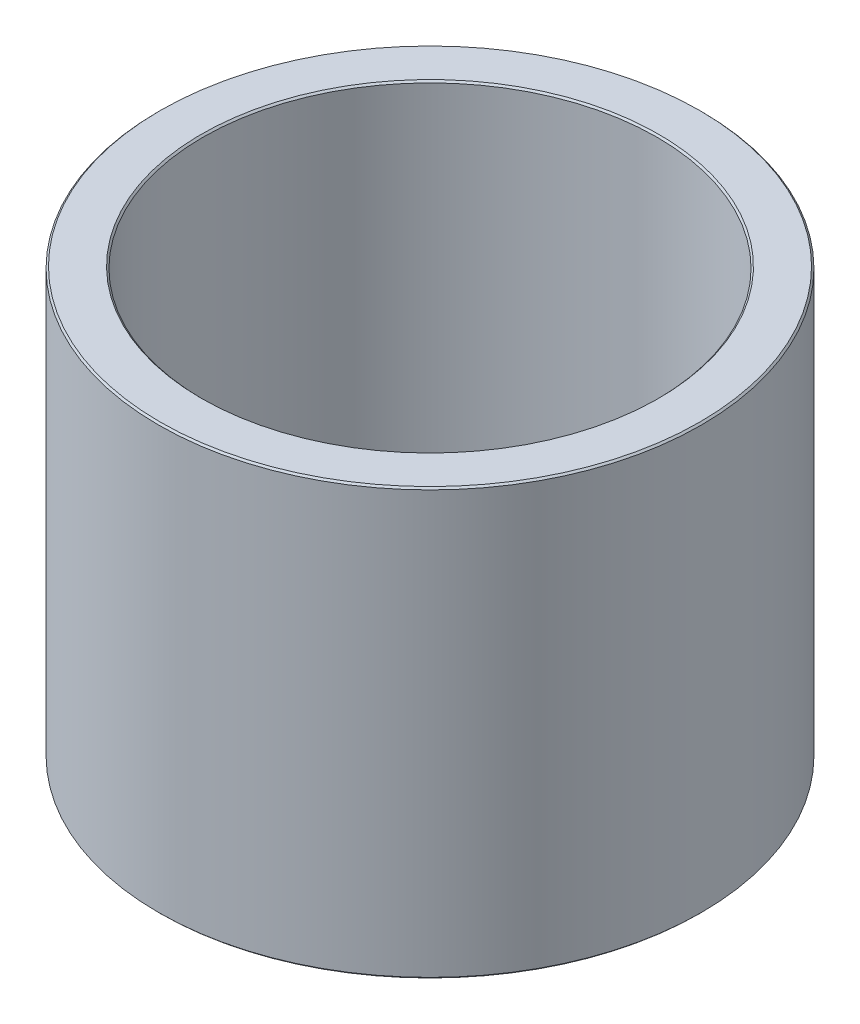
ISO-10303-21;
HEADER;
FILE_DESCRIPTION(('STEP AP214'),'2;1');
FILE_NAME('part.step','',(''),(''),'','','');
FILE_SCHEMA(('AUTOMOTIVE_DESIGN { 1 0 10303 214 1 1 1 1 }'));
ENDSEC;
DATA;
#1=APPLICATION_CONTEXT('core data for automotive mechanical design processes');
#2=APPLICATION_PROTOCOL_DEFINITION('international standard','automotive_design',2000,#1);
#3=PRODUCT_CONTEXT('',#1,'mechanical');
#4=PRODUCT('Part','Part','',(#3));
#5=PRODUCT_RELATED_PRODUCT_CATEGORY('part','',(#4));
#6=PRODUCT_DEFINITION_FORMATION('','',#4);
#7=PRODUCT_DEFINITION_CONTEXT('part definition',#1,'design');
#8=PRODUCT_DEFINITION('design','',#6,#7);
#9=PRODUCT_DEFINITION_SHAPE('','',#8);
#10=(LENGTH_UNIT() NAMED_UNIT(*) SI_UNIT(.MILLI.,.METRE.));
#11=(NAMED_UNIT(*) PLANE_ANGLE_UNIT() SI_UNIT($,.RADIAN.));
#12=(NAMED_UNIT(*) SI_UNIT($,.STERADIAN.) SOLID_ANGLE_UNIT());
#13=UNCERTAINTY_MEASURE_WITH_UNIT(LENGTH_MEASURE(1.E-05),#10,'distance_accuracy_value','');
#14=(GEOMETRIC_REPRESENTATION_CONTEXT(3) GLOBAL_UNCERTAINTY_ASSIGNED_CONTEXT((#13)) GLOBAL_UNIT_ASSIGNED_CONTEXT((#10,
#11,#12)) REPRESENTATION_CONTEXT('',''));
#15=CARTESIAN_POINT('',(0.,0.,0.));
#16=DIRECTION('',(0.,0.,1.));
#17=DIRECTION('',(1.,0.,0.));
#18=AXIS2_PLACEMENT_3D('',#15,#16,#17);
#19=CARTESIAN_POINT('',(0.,78.3762215863073,0.));
#20=DIRECTION('',(0.,-1.,0.));
#21=DIRECTION('',(0.,0.,-1.));
#22=AXIS2_PLACEMENT_3D('',#19,#20,#21);
#23=CYLINDRICAL_SURFACE('',#22,50.);
#24=CARTESIAN_POINT('',(0.,0.312434308337106,0.));
#25=DIRECTION('',(0.,1.,0.));
#26=DIRECTION('',(0.,0.,1.));
#27=AXIS2_PLACEMENT_3D('',#24,#25,#26);
#28=CIRCLE('',#27,50.);
#29=CARTESIAN_POINT('',(0.,0.312434308337106,50.));
#30=VERTEX_POINT('',#29);
#31=EDGE_CURVE('E10',#30,#30,#28,.T.);
#32=ORIENTED_EDGE('',*,*,#31,.T.);
#33=EDGE_LOOP('',(#32));
#34=FACE_BOUND('',#33,.T.);
#35=CARTESIAN_POINT('',(0.,78.0637872779701,0.));
#36=DIRECTION('',(0.,1.,0.));
#37=DIRECTION('',(0.,0.,1.));
#38=AXIS2_PLACEMENT_3D('',#35,#36,#37);
#39=CIRCLE('',#38,50.);
#40=CARTESIAN_POINT('',(0.,78.0637872779701,50.));
#41=VERTEX_POINT('',#40);
#42=EDGE_CURVE('E50',#41,#41,#39,.F.);
#43=ORIENTED_EDGE('',*,*,#42,.T.);
#44=EDGE_LOOP('',(#43));
#45=FACE_BOUND('',#44,.T.);
#46=ADVANCED_FACE('F39',(#34,#45),#23,.T.);
#47=CARTESIAN_POINT('',(0.,78.3762215863073,0.));
#48=DIRECTION('',(0.,1.,0.));
#49=DIRECTION('',(0.,0.,1.));
#50=AXIS2_PLACEMENT_3D('',#47,#48,#49);
#51=PLANE('',#50);
#52=CARTESIAN_POINT('',(0.,78.3762215863073,0.));
#53=DIRECTION('',(0.,1.,0.));
#54=DIRECTION('',(0.,0.,1.));
#55=AXIS2_PLACEMENT_3D('',#52,#53,#54);
#56=CIRCLE('',#55,42.1234506689392);
#57=CARTESIAN_POINT('',(0.,78.3762215863073,42.1234506689392));
#58=VERTEX_POINT('',#57);
#59=EDGE_CURVE('E58',#58,#58,#56,.F.);
#60=ORIENTED_EDGE('',*,*,#59,.T.);
#61=EDGE_LOOP('',(#60));
#62=FACE_BOUND('',#61,.T.);
#63=CARTESIAN_POINT('',(0.,78.3762215863073,0.));
#64=DIRECTION('',(0.,1.,0.));
#65=DIRECTION('',(0.,0.,1.));
#66=AXIS2_PLACEMENT_3D('',#63,#64,#65);
#67=CIRCLE('',#66,49.6875656916629);
#68=CARTESIAN_POINT('',(0.,78.3762215863073,49.6875656916629));
#69=VERTEX_POINT('',#68);
#70=EDGE_CURVE('E61',#69,#69,#67,.T.);
#71=ORIENTED_EDGE('',*,*,#70,.T.);
#72=EDGE_LOOP('',(#71));
#73=FACE_BOUND('',#72,.T.);
#74=ADVANCED_FACE('F88',(#62,#73),#51,.T.);
#75=CARTESIAN_POINT('',(0.,0.,0.));
#76=DIRECTION('',(0.,1.,0.));
#77=DIRECTION('',(0.,0.,1.));
#78=AXIS2_PLACEMENT_3D('',#75,#76,#77);
#79=PLANE('',#78);
#80=CARTESIAN_POINT('',(0.,0.,0.));
#81=DIRECTION('',(0.,1.,0.));
#82=DIRECTION('',(0.,0.,1.));
#83=AXIS2_PLACEMENT_3D('',#80,#81,#82);
#84=CIRCLE('',#83,42.1234506689393);
#85=CARTESIAN_POINT('',(0.,0.,42.1234506689393));
#86=VERTEX_POINT('',#85);
#87=EDGE_CURVE('E51',#86,#86,#84,.T.);
#88=ORIENTED_EDGE('',*,*,#87,.T.);
#89=EDGE_LOOP('',(#88));
#90=FACE_BOUND('',#89,.T.);
#91=CARTESIAN_POINT('',(0.,0.,0.));
#92=DIRECTION('',(0.,1.,0.));
#93=DIRECTION('',(0.,0.,1.));
#94=AXIS2_PLACEMENT_3D('',#91,#92,#93);
#95=CIRCLE('',#94,49.6875656916629);
#96=CARTESIAN_POINT('',(0.,0.,49.6875656916629));
#97=VERTEX_POINT('',#96);
#98=EDGE_CURVE('E54',#97,#97,#95,.F.);
#99=ORIENTED_EDGE('',*,*,#98,.T.);
#100=EDGE_LOOP('',(#99));
#101=FACE_BOUND('',#100,.T.);
#102=ADVANCED_FACE('F83',(#90,#101),#79,.F.);
#103=CARTESIAN_POINT('',(0.,78.3762215863073,0.));
#104=DIRECTION('',(0.,-1.,0.));
#105=DIRECTION('',(0.,0.,-1.));
#106=AXIS2_PLACEMENT_3D('',#103,#104,#105);
#107=CYLINDRICAL_SURFACE('',#106,41.8110163606022);
#108=CARTESIAN_POINT('',(0.,78.0637872779702,0.));
#109=DIRECTION('',(0.,1.,0.));
#110=DIRECTION('',(0.,0.,1.));
#111=AXIS2_PLACEMENT_3D('',#108,#109,#110);
#112=CIRCLE('',#111,41.8110163606022);
#113=CARTESIAN_POINT('',(0.,78.0637872779702,41.8110163606022));
#114=VERTEX_POINT('',#113);
#115=EDGE_CURVE('E67',#114,#114,#112,.T.);
#116=ORIENTED_EDGE('',*,*,#115,.T.);
#117=EDGE_LOOP('',(#116));
#118=FACE_BOUND('',#117,.T.);
#119=CARTESIAN_POINT('',(0.,0.31243430833712,0.));
#120=DIRECTION('',(0.,1.,0.));
#121=DIRECTION('',(0.,0.,1.));
#122=AXIS2_PLACEMENT_3D('',#119,#120,#121);
#123=CIRCLE('',#122,41.8110163606022);
#124=CARTESIAN_POINT('',(0.,0.31243430833712,41.8110163606022));
#125=VERTEX_POINT('',#124);
#126=EDGE_CURVE('E69',#125,#125,#123,.F.);
#127=ORIENTED_EDGE('',*,*,#126,.T.);
#128=EDGE_LOOP('',(#127));
#129=FACE_BOUND('',#128,.T.);
#130=ADVANCED_FACE('F71',(#118,#129),#107,.F.);
#131=CARTESIAN_POINT('',(0.,78.0637872779702,0.));
#132=DIRECTION('',(0.,1.,0.));
#133=DIRECTION('',(0.,0.,1.));
#134=AXIS2_PLACEMENT_3D('',#131,#132,#133);
#135=CONICAL_SURFACE('',#134,41.8110163606022,0.785398163397448);
#136=ORIENTED_EDGE('',*,*,#59,.F.);
#137=EDGE_LOOP('',(#136));
#138=FACE_BOUND('',#137,.T.);
#139=ORIENTED_EDGE('',*,*,#115,.F.);
#140=EDGE_LOOP('',(#139));
#141=FACE_BOUND('',#140,.T.);
#142=ADVANCED_FACE('F77',(#138,#141),#135,.F.);
#143=CARTESIAN_POINT('',(0.,0.,0.));
#144=DIRECTION('',(0.,-1.,0.));
#145=DIRECTION('',(0.,0.,-1.));
#146=AXIS2_PLACEMENT_3D('',#143,#144,#145);
#147=CONICAL_SURFACE('',#146,42.1234506689393,0.785398163397448);
#148=ORIENTED_EDGE('',*,*,#126,.F.);
#149=EDGE_LOOP('',(#148));
#150=FACE_BOUND('',#149,.T.);
#151=ORIENTED_EDGE('',*,*,#87,.F.);
#152=EDGE_LOOP('',(#151));
#153=FACE_BOUND('',#152,.T.);
#154=ADVANCED_FACE('F73',(#150,#153),#147,.F.);
#155=CARTESIAN_POINT('',(0.,0.312434308337106,0.));
#156=DIRECTION('',(0.,1.,0.));
#157=DIRECTION('',(0.,0.,1.));
#158=AXIS2_PLACEMENT_3D('',#155,#156,#157);
#159=CONICAL_SURFACE('',#158,50.,0.785398163397459);
#160=ORIENTED_EDGE('',*,*,#98,.F.);
#161=EDGE_LOOP('',(#160));
#162=FACE_BOUND('',#161,.T.);
#163=ORIENTED_EDGE('',*,*,#31,.F.);
#164=EDGE_LOOP('',(#163));
#165=FACE_BOUND('',#164,.T.);
#166=ADVANCED_FACE('F76',(#162,#165),#159,.T.);
#167=CARTESIAN_POINT('',(0.,78.3762215863073,0.));
#168=DIRECTION('',(0.,-1.,0.));
#169=DIRECTION('',(0.,0.,-1.));
#170=AXIS2_PLACEMENT_3D('',#167,#168,#169);
#171=CONICAL_SURFACE('',#170,49.6875656916629,0.785398163397448);
#172=ORIENTED_EDGE('',*,*,#42,.F.);
#173=EDGE_LOOP('',(#172));
#174=FACE_BOUND('',#173,.T.);
#175=ORIENTED_EDGE('',*,*,#70,.F.);
#176=EDGE_LOOP('',(#175));
#177=FACE_BOUND('',#176,.T.);
#178=ADVANCED_FACE('F45',(#174,#177),#171,.T.);
#179=CLOSED_SHELL('',(#46,#74,#102,#130,#142,#154,#166,#178));
#180=MANIFOLD_SOLID_BREP('B2',#179);
#181=ADVANCED_BREP_SHAPE_REPRESENTATION('',(#18,#180),#14);
#182=SHAPE_DEFINITION_REPRESENTATION(#9,#181);
ENDSEC;
END-ISO-10303-21;
